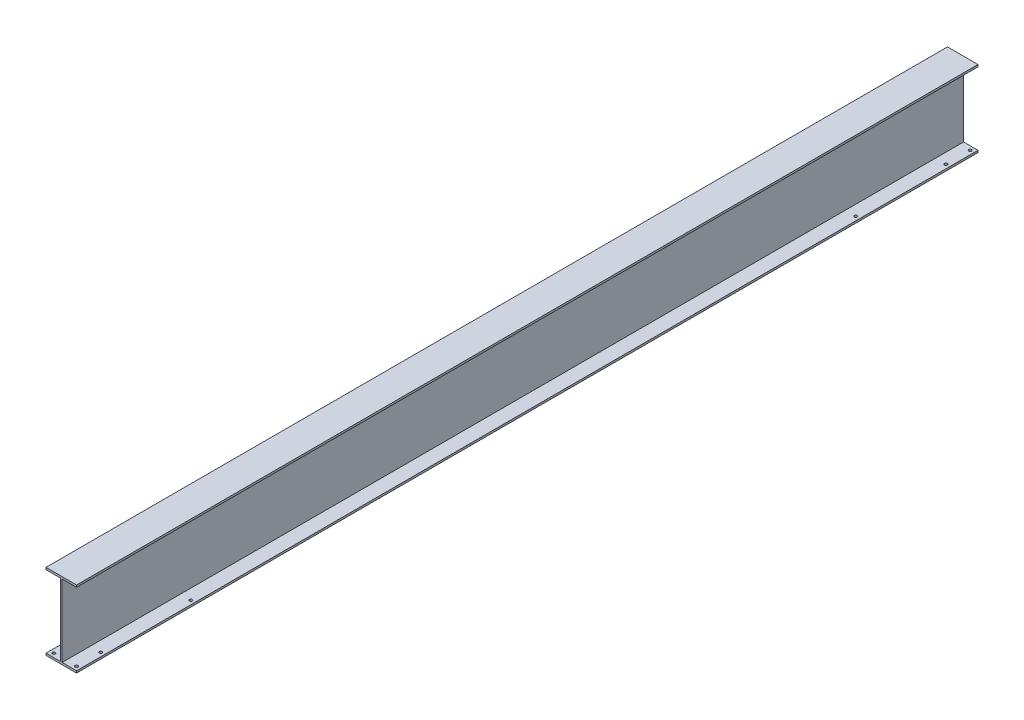
ISO-10303-21;
HEADER;
FILE_DESCRIPTION(('STEP AP214'),'2;1');
FILE_NAME('part.step','',(''),(''),'','','');
FILE_SCHEMA(('AUTOMOTIVE_DESIGN { 1 0 10303 214 1 1 1 1 }'));
ENDSEC;
DATA;
#1=APPLICATION_CONTEXT('core data for automotive mechanical design processes');
#2=APPLICATION_PROTOCOL_DEFINITION('international standard','automotive_design',2000,#1);
#3=PRODUCT_CONTEXT('',#1,'mechanical');
#4=PRODUCT('Part','Part','',(#3));
#5=PRODUCT_RELATED_PRODUCT_CATEGORY('part','',(#4));
#6=PRODUCT_DEFINITION_FORMATION('','',#4);
#7=PRODUCT_DEFINITION_CONTEXT('part definition',#1,'design');
#8=PRODUCT_DEFINITION('design','',#6,#7);
#9=PRODUCT_DEFINITION_SHAPE('','',#8);
#10=(LENGTH_UNIT() NAMED_UNIT(*) SI_UNIT(.MILLI.,.METRE.));
#11=(NAMED_UNIT(*) PLANE_ANGLE_UNIT() SI_UNIT($,.RADIAN.));
#12=(NAMED_UNIT(*) SI_UNIT($,.STERADIAN.) SOLID_ANGLE_UNIT());
#13=UNCERTAINTY_MEASURE_WITH_UNIT(LENGTH_MEASURE(1.E-05),#10,'distance_accuracy_value','');
#14=(GEOMETRIC_REPRESENTATION_CONTEXT(3) GLOBAL_UNCERTAINTY_ASSIGNED_CONTEXT((#13)) GLOBAL_UNIT_ASSIGNED_CONTEXT((#10,
#11,#12)) REPRESENTATION_CONTEXT('',''));
#15=CARTESIAN_POINT('',(0.,0.,0.));
#16=DIRECTION('',(0.,0.,1.));
#17=DIRECTION('',(1.,0.,0.));
#18=AXIS2_PLACEMENT_3D('',#15,#16,#17);
#19=CARTESIAN_POINT('',(0.,0.,3000.));
#20=DIRECTION('',(1.,0.,0.));
#21=DIRECTION('',(0.,1.,0.));
#22=AXIS2_PLACEMENT_3D('',#19,#20,#21);
#23=PLANE('',#22);
#24=DIRECTION('',(0.,-1.,0.));
#25=VECTOR('',#24,1.);
#26=CARTESIAN_POINT('',(0.,0.,0.));
#27=LINE('',#26,#25);
#28=CARTESIAN_POINT('',(0.,0.,0.));
#29=VERTEX_POINT('',#28);
#30=CARTESIAN_POINT('',(0.,-6.8,0.));
#31=VERTEX_POINT('',#30);
#32=EDGE_CURVE('E152',#29,#31,#27,.T.);
#33=ORIENTED_EDGE('',*,*,#32,.T.);
#34=DIRECTION('',(0.,0.,-1.));
#35=VECTOR('',#34,1.);
#36=CARTESIAN_POINT('',(0.,-6.8,3000.));
#37=LINE('',#36,#35);
#38=CARTESIAN_POINT('',(0.,-6.8,3000.));
#39=VERTEX_POINT('',#38);
#40=EDGE_CURVE('E11',#39,#31,#37,.T.);
#41=ORIENTED_EDGE('',*,*,#40,.F.);
#42=DIRECTION('',(0.,-1.,0.));
#43=VECTOR('',#42,1.);
#44=CARTESIAN_POINT('',(0.,0.,3000.));
#45=LINE('',#44,#43);
#46=CARTESIAN_POINT('',(0.,0.,3000.));
#47=VERTEX_POINT('',#46);
#48=EDGE_CURVE('E175',#47,#39,#45,.T.);
#49=ORIENTED_EDGE('',*,*,#48,.F.);
#50=DIRECTION('',(0.,0.,-1.));
#51=VECTOR('',#50,1.);
#52=CARTESIAN_POINT('',(0.,0.,3000.));
#53=LINE('',#52,#51);
#54=EDGE_CURVE('E148',#47,#29,#53,.T.);
#55=ORIENTED_EDGE('',*,*,#54,.T.);
#56=EDGE_LOOP('',(#33,#41,#49,#55));
#57=FACE_BOUND('',#56,.T.);
#58=ADVANCED_FACE('F32',(#57),#23,.F.);
#59=CARTESIAN_POINT('',(0.,-6.8,3000.));
#60=DIRECTION('',(0.,1.,0.));
#61=DIRECTION('',(0.,0.,1.));
#62=AXIS2_PLACEMENT_3D('',#59,#60,#61);
#63=PLANE('',#62);
#64=DIRECTION('',(1.,0.,0.));
#65=VECTOR('',#64,1.);
#66=CARTESIAN_POINT('',(0.,-6.8,0.));
#67=LINE('',#66,#65);
#68=CARTESIAN_POINT('',(47.9,-6.8,0.));
#69=VERTEX_POINT('',#68);
#70=EDGE_CURVE('E155',#31,#69,#67,.T.);
#71=ORIENTED_EDGE('',*,*,#70,.T.);
#72=DIRECTION('',(0.,0.,-1.));
#73=VECTOR('',#72,1.);
#74=CARTESIAN_POINT('',(47.9,-6.8,3000.));
#75=LINE('',#74,#73);
#76=CARTESIAN_POINT('',(47.9,-6.8,3000.));
#77=VERTEX_POINT('',#76);
#78=EDGE_CURVE('E40',#77,#69,#75,.T.);
#79=ORIENTED_EDGE('',*,*,#78,.F.);
#80=DIRECTION('',(1.,0.,0.));
#81=VECTOR('',#80,1.);
#82=CARTESIAN_POINT('',(0.,-6.8,3000.));
#83=LINE('',#82,#81);
#84=EDGE_CURVE('E103',#39,#77,#83,.T.);
#85=ORIENTED_EDGE('',*,*,#84,.F.);
#86=ORIENTED_EDGE('',*,*,#40,.T.);
#87=EDGE_LOOP('',(#71,#79,#85,#86));
#88=FACE_BOUND('',#87,.T.);
#89=ADVANCED_FACE('F253',(#88),#63,.F.);
#90=CARTESIAN_POINT('',(47.9,-6.8,3000.));
#91=DIRECTION('',(1.,0.,0.));
#92=DIRECTION('',(0.,1.,0.));
#93=AXIS2_PLACEMENT_3D('',#90,#91,#92);
#94=PLANE('',#93);
#95=DIRECTION('',(0.,-1.,0.));
#96=VECTOR('',#95,1.);
#97=CARTESIAN_POINT('',(47.9,-6.8,0.));
#98=LINE('',#97,#96);
#99=CARTESIAN_POINT('',(47.9,-247.2,0.));
#100=VERTEX_POINT('',#99);
#101=EDGE_CURVE('E158',#69,#100,#98,.T.);
#102=ORIENTED_EDGE('',*,*,#101,.T.);
#103=DIRECTION('',(0.,0.,-1.));
#104=VECTOR('',#103,1.);
#105=CARTESIAN_POINT('',(47.9,-247.2,3000.));
#106=LINE('',#105,#104);
#107=CARTESIAN_POINT('',(47.9,-247.2,3000.));
#108=VERTEX_POINT('',#107);
#109=EDGE_CURVE('E194',#108,#100,#106,.T.);
#110=ORIENTED_EDGE('',*,*,#109,.F.);
#111=DIRECTION('',(0.,-1.,0.));
#112=VECTOR('',#111,1.);
#113=CARTESIAN_POINT('',(47.9,-6.8,3000.));
#114=LINE('',#113,#112);
#115=EDGE_CURVE('E202',#77,#108,#114,.T.);
#116=ORIENTED_EDGE('',*,*,#115,.F.);
#117=ORIENTED_EDGE('',*,*,#78,.T.);
#118=EDGE_LOOP('',(#102,#110,#116,#117));
#119=FACE_BOUND('',#118,.T.);
#120=ADVANCED_FACE('F200',(#119),#94,.F.);
#121=CARTESIAN_POINT('',(47.9,-247.2,3000.));
#122=DIRECTION('',(0.,-1.,0.));
#123=DIRECTION('',(0.,0.,-1.));
#124=AXIS2_PLACEMENT_3D('',#121,#122,#123);
#125=PLANE('',#124);
#126=CARTESIAN_POINT('',(12.9999999999997,-247.2,2606.6));
#127=DIRECTION('',(0.,-1.,0.));
#128=DIRECTION('',(0.,0.,-1.));
#129=AXIS2_PLACEMENT_3D('',#126,#127,#128);
#130=CIRCLE('',#129,4.76250000000005);
#131=CARTESIAN_POINT('',(12.9999999999997,-247.2,2601.8375));
#132=VERTEX_POINT('',#131);
#133=EDGE_CURVE('E445',#132,#132,#130,.F.);
#134=ORIENTED_EDGE('',*,*,#133,.F.);
#135=EDGE_LOOP('',(#134));
#136=FACE_BOUND('',#135,.T.);
#137=CARTESIAN_POINT('',(13.,-247.2,393.4));
#138=DIRECTION('',(0.,-1.,0.));
#139=DIRECTION('',(0.,0.,-1.));
#140=AXIS2_PLACEMENT_3D('',#137,#138,#139);
#141=CIRCLE('',#140,4.76250000000003);
#142=CARTESIAN_POINT('',(13.,-247.2,388.6375));
#143=VERTEX_POINT('',#142);
#144=EDGE_CURVE('E450',#143,#143,#141,.F.);
#145=ORIENTED_EDGE('',*,*,#144,.F.);
#146=EDGE_LOOP('',(#145));
#147=FACE_BOUND('',#146,.T.);
#148=CARTESIAN_POINT('',(12.9999999999997,-247.2,2906.61));
#149=DIRECTION('',(0.,-1.,0.));
#150=DIRECTION('',(0.,0.,-1.));
#151=AXIS2_PLACEMENT_3D('',#148,#149,#150);
#152=CIRCLE('',#151,4.76250000000005);
#153=CARTESIAN_POINT('',(12.9999999999997,-247.2,2901.8475));
#154=VERTEX_POINT('',#153);
#155=EDGE_CURVE('E506',#154,#154,#152,.F.);
#156=ORIENTED_EDGE('',*,*,#155,.F.);
#157=EDGE_LOOP('',(#156));
#158=FACE_BOUND('',#157,.T.);
#159=CARTESIAN_POINT('',(12.9999999999997,-247.2,2987.));
#160=DIRECTION('',(0.,-1.,0.));
#161=DIRECTION('',(0.,0.,-1.));
#162=AXIS2_PLACEMENT_3D('',#159,#160,#161);
#163=CIRCLE('',#162,4.76250000000005);
#164=CARTESIAN_POINT('',(12.9999999999997,-247.2,2982.2375));
#165=VERTEX_POINT('',#164);
#166=EDGE_CURVE('E487',#165,#165,#163,.F.);
#167=ORIENTED_EDGE('',*,*,#166,.F.);
#168=EDGE_LOOP('',(#167));
#169=FACE_BOUND('',#168,.T.);
#170=CARTESIAN_POINT('',(13.,-247.2,12.9999999999999));
#171=DIRECTION('',(0.,-1.,0.));
#172=DIRECTION('',(0.,0.,-1.));
#173=AXIS2_PLACEMENT_3D('',#170,#171,#172);
#174=CIRCLE('',#173,4.76250000000003);
#175=CARTESIAN_POINT('',(13.,-247.2,8.23749999999987));
#176=VERTEX_POINT('',#175);
#177=EDGE_CURVE('E488',#176,#176,#174,.F.);
#178=ORIENTED_EDGE('',*,*,#177,.F.);
#179=EDGE_LOOP('',(#178));
#180=FACE_BOUND('',#179,.T.);
#181=CARTESIAN_POINT('',(13.,-247.2,93.3899999999999));
#182=DIRECTION('',(0.,-1.,0.));
#183=DIRECTION('',(0.,0.,-1.));
#184=AXIS2_PLACEMENT_3D('',#181,#182,#183);
#185=CIRCLE('',#184,4.76250000000003);
#186=CARTESIAN_POINT('',(13.,-247.2,88.6274999999998));
#187=VERTEX_POINT('',#186);
#188=EDGE_CURVE('E495',#187,#187,#185,.F.);
#189=ORIENTED_EDGE('',*,*,#188,.F.);
#190=EDGE_LOOP('',(#189));
#191=FACE_BOUND('',#190,.T.);
#192=DIRECTION('',(-1.,0.,0.));
#193=VECTOR('',#192,1.);
#194=CARTESIAN_POINT('',(47.9,-247.2,0.));
#195=LINE('',#194,#193);
#196=CARTESIAN_POINT('',(0.,-247.2,0.));
#197=VERTEX_POINT('',#196);
#198=EDGE_CURVE('E160',#100,#197,#195,.T.);
#199=ORIENTED_EDGE('',*,*,#198,.T.);
#200=DIRECTION('',(0.,0.,-1.));
#201=VECTOR('',#200,1.);
#202=CARTESIAN_POINT('',(0.,-247.2,3000.));
#203=LINE('',#202,#201);
#204=CARTESIAN_POINT('',(0.,-247.2,3000.));
#205=VERTEX_POINT('',#204);
#206=EDGE_CURVE('E191',#205,#197,#203,.T.);
#207=ORIENTED_EDGE('',*,*,#206,.F.);
#208=DIRECTION('',(-1.,0.,0.));
#209=VECTOR('',#208,1.);
#210=CARTESIAN_POINT('',(47.9,-247.2,3000.));
#211=LINE('',#210,#209);
#212=EDGE_CURVE('E220',#108,#205,#211,.T.);
#213=ORIENTED_EDGE('',*,*,#212,.F.);
#214=ORIENTED_EDGE('',*,*,#109,.T.);
#215=EDGE_LOOP('',(#199,#207,#213,#214));
#216=FACE_BOUND('',#215,.T.);
#217=ADVANCED_FACE('F211',(#136,#147,#158,#169,#180,#191,#216),#125,.F.);
#218=CARTESIAN_POINT('',(0.,-247.2,3000.));
#219=DIRECTION('',(1.,0.,0.));
#220=DIRECTION('',(0.,1.,0.));
#221=AXIS2_PLACEMENT_3D('',#218,#219,#220);
#222=PLANE('',#221);
#223=DIRECTION('',(0.,-1.,0.));
#224=VECTOR('',#223,1.);
#225=CARTESIAN_POINT('',(0.,-247.2,0.));
#226=LINE('',#225,#224);
#227=CARTESIAN_POINT('',(0.,-254.,0.));
#228=VERTEX_POINT('',#227);
#229=EDGE_CURVE('E162',#197,#228,#226,.T.);
#230=ORIENTED_EDGE('',*,*,#229,.T.);
#231=DIRECTION('',(0.,0.,-1.));
#232=VECTOR('',#231,1.);
#233=CARTESIAN_POINT('',(0.,-254.,3000.));
#234=LINE('',#233,#232);
#235=CARTESIAN_POINT('',(0.,-254.,3000.));
#236=VERTEX_POINT('',#235);
#237=EDGE_CURVE('E188',#236,#228,#234,.T.);
#238=ORIENTED_EDGE('',*,*,#237,.F.);
#239=DIRECTION('',(0.,-1.,0.));
#240=VECTOR('',#239,1.);
#241=CARTESIAN_POINT('',(0.,-247.2,3000.));
#242=LINE('',#241,#240);
#243=EDGE_CURVE('E217',#205,#236,#242,.T.);
#244=ORIENTED_EDGE('',*,*,#243,.F.);
#245=ORIENTED_EDGE('',*,*,#206,.T.);
#246=EDGE_LOOP('',(#230,#238,#244,#245));
#247=FACE_BOUND('',#246,.T.);
#248=ADVANCED_FACE('F215',(#247),#222,.F.);
#249=CARTESIAN_POINT('',(0.,-254.,3000.));
#250=DIRECTION('',(0.,1.,0.));
#251=DIRECTION('',(0.,0.,1.));
#252=AXIS2_PLACEMENT_3D('',#249,#250,#251);
#253=PLANE('',#252);
#254=CARTESIAN_POINT('',(88.5999999999997,-254.,2606.6));
#255=DIRECTION('',(0.,-1.,0.));
#256=DIRECTION('',(0.,0.,-1.));
#257=AXIS2_PLACEMENT_3D('',#254,#255,#256);
#258=CIRCLE('',#257,4.76250000000005);
#259=CARTESIAN_POINT('',(88.5999999999997,-254.,2601.8375));
#260=VERTEX_POINT('',#259);
#261=EDGE_CURVE('E452',#260,#260,#258,.T.);
#262=ORIENTED_EDGE('',*,*,#261,.F.);
#263=EDGE_LOOP('',(#262));
#264=FACE_BOUND('',#263,.T.);
#265=CARTESIAN_POINT('',(88.6,-254.,12.9999999999999));
#266=DIRECTION('',(0.,-1.,0.));
#267=DIRECTION('',(0.,0.,1.));
#268=AXIS2_PLACEMENT_3D('',#265,#266,#267);
#269=CIRCLE('',#268,4.76250000000003);
#270=CARTESIAN_POINT('',(88.6,-254.,17.7624999999999));
#271=VERTEX_POINT('',#270);
#272=EDGE_CURVE('E466',#271,#271,#269,.T.);
#273=ORIENTED_EDGE('',*,*,#272,.F.);
#274=EDGE_LOOP('',(#273));
#275=FACE_BOUND('',#274,.T.);
#276=CARTESIAN_POINT('',(88.6,-254.,93.3899999999999));
#277=DIRECTION('',(0.,-1.,0.));
#278=DIRECTION('',(0.,0.,1.));
#279=AXIS2_PLACEMENT_3D('',#276,#277,#278);
#280=CIRCLE('',#279,4.76250000000004);
#281=CARTESIAN_POINT('',(88.6,-254.,98.1524999999999));
#282=VERTEX_POINT('',#281);
#283=EDGE_CURVE('E473',#282,#282,#280,.T.);
#284=ORIENTED_EDGE('',*,*,#283,.F.);
#285=EDGE_LOOP('',(#284));
#286=FACE_BOUND('',#285,.T.);
#287=CARTESIAN_POINT('',(12.9999999999997,-254.,2606.6));
#288=DIRECTION('',(0.,-1.,0.));
#289=DIRECTION('',(0.,0.,1.));
#290=AXIS2_PLACEMENT_3D('',#287,#288,#289);
#291=CIRCLE('',#290,4.76250000000005);
#292=CARTESIAN_POINT('',(12.9999999999997,-254.,2611.3625));
#293=VERTEX_POINT('',#292);
#294=EDGE_CURVE('E448',#293,#293,#291,.T.);
#295=ORIENTED_EDGE('',*,*,#294,.F.);
#296=EDGE_LOOP('',(#295));
#297=FACE_BOUND('',#296,.T.);
#298=CARTESIAN_POINT('',(13.,-254.,393.4));
#299=DIRECTION('',(0.,-1.,0.));
#300=DIRECTION('',(0.,0.,-1.));
#301=AXIS2_PLACEMENT_3D('',#298,#299,#300);
#302=CIRCLE('',#301,4.76250000000003);
#303=CARTESIAN_POINT('',(13.,-254.,388.6375));
#304=VERTEX_POINT('',#303);
#305=EDGE_CURVE('E455',#304,#304,#302,.T.);
#306=ORIENTED_EDGE('',*,*,#305,.F.);
#307=EDGE_LOOP('',(#306));
#308=FACE_BOUND('',#307,.T.);
#309=CARTESIAN_POINT('',(88.6,-254.,393.4));
#310=DIRECTION('',(0.,-1.,0.));
#311=DIRECTION('',(0.,0.,1.));
#312=AXIS2_PLACEMENT_3D('',#309,#310,#311);
#313=CIRCLE('',#312,4.76250000000004);
#314=CARTESIAN_POINT('',(88.6,-254.,398.1625));
#315=VERTEX_POINT('',#314);
#316=EDGE_CURVE('E461',#315,#315,#313,.T.);
#317=ORIENTED_EDGE('',*,*,#316,.F.);
#318=EDGE_LOOP('',(#317));
#319=FACE_BOUND('',#318,.T.);
#320=CARTESIAN_POINT('',(88.5999999999997,-254.,2906.61));
#321=DIRECTION('',(0.,-1.,0.));
#322=DIRECTION('',(0.,0.,-1.));
#323=AXIS2_PLACEMENT_3D('',#320,#321,#322);
#324=CIRCLE('',#323,4.76250000000005);
#325=CARTESIAN_POINT('',(88.5999999999997,-254.,2901.8475));
#326=VERTEX_POINT('',#325);
#327=EDGE_CURVE('E502',#326,#326,#324,.T.);
#328=ORIENTED_EDGE('',*,*,#327,.F.);
#329=EDGE_LOOP('',(#328));
#330=FACE_BOUND('',#329,.T.);
#331=CARTESIAN_POINT('',(12.9999999999997,-254.,2906.61));
#332=DIRECTION('',(0.,-1.,0.));
#333=DIRECTION('',(0.,0.,1.));
#334=AXIS2_PLACEMENT_3D('',#331,#332,#333);
#335=CIRCLE('',#334,4.76250000000005);
#336=CARTESIAN_POINT('',(12.9999999999997,-254.,2911.3725));
#337=VERTEX_POINT('',#336);
#338=EDGE_CURVE('E491',#337,#337,#335,.T.);
#339=ORIENTED_EDGE('',*,*,#338,.F.);
#340=EDGE_LOOP('',(#339));
#341=FACE_BOUND('',#340,.T.);
#342=CARTESIAN_POINT('',(12.9999999999997,-254.,2987.));
#343=DIRECTION('',(0.,-1.,0.));
#344=DIRECTION('',(0.,0.,1.));
#345=AXIS2_PLACEMENT_3D('',#342,#343,#344);
#346=CIRCLE('',#345,4.76250000000005);
#347=CARTESIAN_POINT('',(12.9999999999997,-254.,2991.7625));
#348=VERTEX_POINT('',#347);
#349=EDGE_CURVE('E484',#348,#348,#346,.T.);
#350=ORIENTED_EDGE('',*,*,#349,.F.);
#351=EDGE_LOOP('',(#350));
#352=FACE_BOUND('',#351,.T.);
#353=CARTESIAN_POINT('',(13.,-254.,12.9999999999999));
#354=DIRECTION('',(0.,-1.,0.));
#355=DIRECTION('',(0.,0.,-1.));
#356=AXIS2_PLACEMENT_3D('',#353,#354,#355);
#357=CIRCLE('',#356,4.76250000000003);
#358=CARTESIAN_POINT('',(13.,-254.,8.23749999999987));
#359=VERTEX_POINT('',#358);
#360=EDGE_CURVE('E492',#359,#359,#357,.T.);
#361=ORIENTED_EDGE('',*,*,#360,.F.);
#362=EDGE_LOOP('',(#361));
#363=FACE_BOUND('',#362,.T.);
#364=CARTESIAN_POINT('',(13.,-254.,93.3899999999999));
#365=DIRECTION('',(0.,-1.,0.));
#366=DIRECTION('',(0.,0.,-1.));
#367=AXIS2_PLACEMENT_3D('',#364,#365,#366);
#368=CIRCLE('',#367,4.76250000000003);
#369=CARTESIAN_POINT('',(13.,-254.,88.6274999999998));
#370=VERTEX_POINT('',#369);
#371=EDGE_CURVE('E483',#370,#370,#368,.T.);
#372=ORIENTED_EDGE('',*,*,#371,.F.);
#373=EDGE_LOOP('',(#372));
#374=FACE_BOUND('',#373,.T.);
#375=CARTESIAN_POINT('',(88.5999999999997,-254.,2987.));
#376=DIRECTION('',(0.,-1.,0.));
#377=DIRECTION('',(0.,0.,-1.));
#378=AXIS2_PLACEMENT_3D('',#375,#376,#377);
#379=CIRCLE('',#378,4.76250000000005);
#380=CARTESIAN_POINT('',(88.5999999999997,-254.,2982.2375));
#381=VERTEX_POINT('',#380);
#382=EDGE_CURVE('E509',#381,#381,#379,.T.);
#383=ORIENTED_EDGE('',*,*,#382,.F.);
#384=EDGE_LOOP('',(#383));
#385=FACE_BOUND('',#384,.T.);
#386=DIRECTION('',(1.,0.,0.));
#387=VECTOR('',#386,1.);
#388=CARTESIAN_POINT('',(0.,-254.,0.));
#389=LINE('',#388,#387);
#390=CARTESIAN_POINT('',(101.6,-254.,0.));
#391=VERTEX_POINT('',#390);
#392=EDGE_CURVE('E164',#228,#391,#389,.T.);
#393=ORIENTED_EDGE('',*,*,#392,.T.);
#394=DIRECTION('',(0.,0.,-1.));
#395=VECTOR('',#394,1.);
#396=CARTESIAN_POINT('',(101.6,-254.,3000.));
#397=LINE('',#396,#395);
#398=CARTESIAN_POINT('',(101.6,-254.,3000.));
#399=VERTEX_POINT('',#398);
#400=EDGE_CURVE('E185',#399,#391,#397,.T.);
#401=ORIENTED_EDGE('',*,*,#400,.F.);
#402=DIRECTION('',(1.,0.,0.));
#403=VECTOR('',#402,1.);
#404=CARTESIAN_POINT('',(0.,-254.,3000.));
#405=LINE('',#404,#403);
#406=EDGE_CURVE('E219',#236,#399,#405,.T.);
#407=ORIENTED_EDGE('',*,*,#406,.F.);
#408=ORIENTED_EDGE('',*,*,#237,.T.);
#409=EDGE_LOOP('',(#393,#401,#407,#408));
#410=FACE_BOUND('',#409,.T.);
#411=ADVANCED_FACE('F267',(#264,#275,#286,#297,#308,#319,#330,#341,#352,#363,#374,#385,#410),
#253,.F.);
#412=CARTESIAN_POINT('',(101.6,-247.2,3000.));
#413=DIRECTION('',(-1.,0.,0.));
#414=DIRECTION('',(0.,0.,1.));
#415=AXIS2_PLACEMENT_3D('',#412,#413,#414);
#416=PLANE('',#415);
#417=DIRECTION('',(0.,1.,0.));
#418=VECTOR('',#417,1.);
#419=CARTESIAN_POINT('',(101.6,-247.2,0.));
#420=LINE('',#419,#418);
#421=CARTESIAN_POINT('',(101.6,-247.2,0.));
#422=VERTEX_POINT('',#421);
#423=EDGE_CURVE('E166',#391,#422,#420,.T.);
#424=ORIENTED_EDGE('',*,*,#423,.T.);
#425=DIRECTION('',(0.,0.,-1.));
#426=VECTOR('',#425,1.);
#427=CARTESIAN_POINT('',(101.6,-247.2,3000.));
#428=LINE('',#427,#426);
#429=CARTESIAN_POINT('',(101.6,-247.2,3000.));
#430=VERTEX_POINT('',#429);
#431=EDGE_CURVE('E182',#430,#422,#428,.T.);
#432=ORIENTED_EDGE('',*,*,#431,.F.);
#433=DIRECTION('',(0.,1.,0.));
#434=VECTOR('',#433,1.);
#435=CARTESIAN_POINT('',(101.6,-247.2,3000.));
#436=LINE('',#435,#434);
#437=EDGE_CURVE('E222',#399,#430,#436,.T.);
#438=ORIENTED_EDGE('',*,*,#437,.F.);
#439=ORIENTED_EDGE('',*,*,#400,.T.);
#440=EDGE_LOOP('',(#424,#432,#438,#439));
#441=FACE_BOUND('',#440,.T.);
#442=ADVANCED_FACE('F270',(#441),#416,.F.);
#443=CARTESIAN_POINT('',(53.7,-247.2,3000.));
#444=DIRECTION('',(0.,-1.,0.));
#445=DIRECTION('',(0.,0.,-1.));
#446=AXIS2_PLACEMENT_3D('',#443,#444,#445);
#447=PLANE('',#446);
#448=CARTESIAN_POINT('',(88.5999999999997,-247.2,2606.6));
#449=DIRECTION('',(0.,-1.,0.));
#450=DIRECTION('',(0.,0.,-1.));
#451=AXIS2_PLACEMENT_3D('',#448,#449,#450);
#452=CIRCLE('',#451,4.76250000000005);
#453=CARTESIAN_POINT('',(88.5999999999997,-247.2,2601.8375));
#454=VERTEX_POINT('',#453);
#455=EDGE_CURVE('E470',#454,#454,#452,.F.);
#456=ORIENTED_EDGE('',*,*,#455,.F.);
#457=EDGE_LOOP('',(#456));
#458=FACE_BOUND('',#457,.T.);
#459=CARTESIAN_POINT('',(88.6,-247.2,12.9999999999999));
#460=DIRECTION('',(0.,-1.,0.));
#461=DIRECTION('',(0.,0.,-1.));
#462=AXIS2_PLACEMENT_3D('',#459,#460,#461);
#463=CIRCLE('',#462,4.76250000000003);
#464=CARTESIAN_POINT('',(88.6,-247.2,8.23749999999988));
#465=VERTEX_POINT('',#464);
#466=EDGE_CURVE('E469',#465,#465,#463,.F.);
#467=ORIENTED_EDGE('',*,*,#466,.F.);
#468=EDGE_LOOP('',(#467));
#469=FACE_BOUND('',#468,.T.);
#470=CARTESIAN_POINT('',(88.6,-247.2,93.3899999999999));
#471=DIRECTION('',(0.,-1.,0.));
#472=DIRECTION('',(0.,0.,-1.));
#473=AXIS2_PLACEMENT_3D('',#470,#471,#472);
#474=CIRCLE('',#473,4.76250000000004);
#475=CARTESIAN_POINT('',(88.6,-247.2,88.6274999999998));
#476=VERTEX_POINT('',#475);
#477=EDGE_CURVE('E480',#476,#476,#474,.F.);
#478=ORIENTED_EDGE('',*,*,#477,.F.);
#479=EDGE_LOOP('',(#478));
#480=FACE_BOUND('',#479,.T.);
#481=CARTESIAN_POINT('',(88.6,-247.2,393.4));
#482=DIRECTION('',(0.,-1.,0.));
#483=DIRECTION('',(0.,0.,-1.));
#484=AXIS2_PLACEMENT_3D('',#481,#482,#483);
#485=CIRCLE('',#484,4.76250000000004);
#486=CARTESIAN_POINT('',(88.6,-247.2,388.6375));
#487=VERTEX_POINT('',#486);
#488=EDGE_CURVE('E459',#487,#487,#485,.F.);
#489=ORIENTED_EDGE('',*,*,#488,.F.);
#490=EDGE_LOOP('',(#489));
#491=FACE_BOUND('',#490,.T.);
#492=CARTESIAN_POINT('',(88.5999999999997,-247.2,2906.61));
#493=DIRECTION('',(0.,-1.,0.));
#494=DIRECTION('',(0.,0.,-1.));
#495=AXIS2_PLACEMENT_3D('',#492,#493,#494);
#496=CIRCLE('',#495,4.76250000000005);
#497=CARTESIAN_POINT('',(88.5999999999997,-247.2,2901.8475));
#498=VERTEX_POINT('',#497);
#499=EDGE_CURVE('E505',#498,#498,#496,.F.);
#500=ORIENTED_EDGE('',*,*,#499,.F.);
#501=EDGE_LOOP('',(#500));
#502=FACE_BOUND('',#501,.T.);
#503=CARTESIAN_POINT('',(88.5999999999997,-247.2,2987.));
#504=DIRECTION('',(0.,-1.,0.));
#505=DIRECTION('',(0.,0.,-1.));
#506=AXIS2_PLACEMENT_3D('',#503,#504,#505);
#507=CIRCLE('',#506,4.76250000000005);
#508=CARTESIAN_POINT('',(88.5999999999997,-247.2,2982.2375));
#509=VERTEX_POINT('',#508);
#510=EDGE_CURVE('E156',#509,#509,#507,.F.);
#511=ORIENTED_EDGE('',*,*,#510,.F.);
#512=EDGE_LOOP('',(#511));
#513=FACE_BOUND('',#512,.T.);
#514=DIRECTION('',(-1.,0.,0.));
#515=VECTOR('',#514,1.);
#516=CARTESIAN_POINT('',(53.7,-247.2,0.));
#517=LINE('',#516,#515);
#518=CARTESIAN_POINT('',(53.7,-247.2,0.));
#519=VERTEX_POINT('',#518);
#520=EDGE_CURVE('E168',#422,#519,#517,.T.);
#521=ORIENTED_EDGE('',*,*,#520,.T.);
#522=DIRECTION('',(0.,0.,-1.));
#523=VECTOR('',#522,1.);
#524=CARTESIAN_POINT('',(53.7,-247.2,3000.));
#525=LINE('',#524,#523);
#526=CARTESIAN_POINT('',(53.7,-247.2,3000.));
#527=VERTEX_POINT('',#526);
#528=EDGE_CURVE('E179',#527,#519,#525,.T.);
#529=ORIENTED_EDGE('',*,*,#528,.F.);
#530=DIRECTION('',(-1.,0.,0.));
#531=VECTOR('',#530,1.);
#532=CARTESIAN_POINT('',(53.7,-247.2,3000.));
#533=LINE('',#532,#531);
#534=EDGE_CURVE('E228',#430,#527,#533,.T.);
#535=ORIENTED_EDGE('',*,*,#534,.F.);
#536=ORIENTED_EDGE('',*,*,#431,.T.);
#537=EDGE_LOOP('',(#521,#529,#535,#536));
#538=FACE_BOUND('',#537,.T.);
#539=ADVANCED_FACE('F234',(#458,#469,#480,#491,#502,#513,#538),#447,.F.);
#540=CARTESIAN_POINT('',(53.7,-6.8,3000.));
#541=DIRECTION('',(-1.,0.,0.));
#542=DIRECTION('',(0.,-1.,0.));
#543=AXIS2_PLACEMENT_3D('',#540,#541,#542);
#544=PLANE('',#543);
#545=DIRECTION('',(0.,1.,0.));
#546=VECTOR('',#545,1.);
#547=CARTESIAN_POINT('',(53.7,-6.8,0.));
#548=LINE('',#547,#546);
#549=CARTESIAN_POINT('',(53.7,-6.8,0.));
#550=VERTEX_POINT('',#549);
#551=EDGE_CURVE('E170',#519,#550,#548,.T.);
#552=ORIENTED_EDGE('',*,*,#551,.T.);
#553=DIRECTION('',(0.,0.,-1.));
#554=VECTOR('',#553,1.);
#555=CARTESIAN_POINT('',(53.7,-6.8,3000.));
#556=LINE('',#555,#554);
#557=CARTESIAN_POINT('',(53.7,-6.8,3000.));
#558=VERTEX_POINT('',#557);
#559=EDGE_CURVE('E143',#558,#550,#556,.T.);
#560=ORIENTED_EDGE('',*,*,#559,.F.);
#561=DIRECTION('',(0.,1.,0.));
#562=VECTOR('',#561,1.);
#563=CARTESIAN_POINT('',(53.7,-6.8,3000.));
#564=LINE('',#563,#562);
#565=EDGE_CURVE('E134',#527,#558,#564,.T.);
#566=ORIENTED_EDGE('',*,*,#565,.F.);
#567=ORIENTED_EDGE('',*,*,#528,.T.);
#568=EDGE_LOOP('',(#552,#560,#566,#567));
#569=FACE_BOUND('',#568,.T.);
#570=ADVANCED_FACE('F238',(#569),#544,.F.);
#571=CARTESIAN_POINT('',(101.6,-6.79999999999999,3000.));
#572=DIRECTION('',(0.,1.,0.));
#573=DIRECTION('',(-1.,0.,0.));
#574=AXIS2_PLACEMENT_3D('',#571,#572,#573);
#575=PLANE('',#574);
#576=DIRECTION('',(1.,0.,0.));
#577=VECTOR('',#576,1.);
#578=CARTESIAN_POINT('',(101.6,-6.79999999999999,0.));
#579=LINE('',#578,#577);
#580=CARTESIAN_POINT('',(101.6,-6.79999999999999,0.));
#581=VERTEX_POINT('',#580);
#582=EDGE_CURVE('E142',#550,#581,#579,.T.);
#583=ORIENTED_EDGE('',*,*,#582,.T.);
#584=DIRECTION('',(0.,0.,-1.));
#585=VECTOR('',#584,1.);
#586=CARTESIAN_POINT('',(101.6,-6.79999999999999,3000.));
#587=LINE('',#586,#585);
#588=CARTESIAN_POINT('',(101.6,-6.79999999999999,3000.));
#589=VERTEX_POINT('',#588);
#590=EDGE_CURVE('E139',#589,#581,#587,.T.);
#591=ORIENTED_EDGE('',*,*,#590,.F.);
#592=DIRECTION('',(1.,0.,0.));
#593=VECTOR('',#592,1.);
#594=CARTESIAN_POINT('',(101.6,-6.79999999999999,3000.));
#595=LINE('',#594,#593);
#596=EDGE_CURVE('E128',#558,#589,#595,.T.);
#597=ORIENTED_EDGE('',*,*,#596,.F.);
#598=ORIENTED_EDGE('',*,*,#559,.T.);
#599=EDGE_LOOP('',(#583,#591,#597,#598));
#600=FACE_BOUND('',#599,.T.);
#601=ADVANCED_FACE('F140',(#600),#575,.F.);
#602=CARTESIAN_POINT('',(101.6,0.,3000.));
#603=DIRECTION('',(-1.,0.,0.));
#604=DIRECTION('',(0.,0.,1.));
#605=AXIS2_PLACEMENT_3D('',#602,#603,#604);
#606=PLANE('',#605);
#607=DIRECTION('',(0.,1.,0.));
#608=VECTOR('',#607,1.);
#609=CARTESIAN_POINT('',(101.6,0.,0.));
#610=LINE('',#609,#608);
#611=CARTESIAN_POINT('',(101.6,0.,0.));
#612=VERTEX_POINT('',#611);
#613=EDGE_CURVE('E89',#581,#612,#610,.T.);
#614=ORIENTED_EDGE('',*,*,#613,.T.);
#615=DIRECTION('',(0.,0.,-1.));
#616=VECTOR('',#615,1.);
#617=CARTESIAN_POINT('',(101.6,0.,3000.));
#618=LINE('',#617,#616);
#619=CARTESIAN_POINT('',(101.6,0.,3000.));
#620=VERTEX_POINT('',#619);
#621=EDGE_CURVE('E144',#620,#612,#618,.T.);
#622=ORIENTED_EDGE('',*,*,#621,.F.);
#623=DIRECTION('',(0.,1.,0.));
#624=VECTOR('',#623,1.);
#625=CARTESIAN_POINT('',(101.6,0.,3000.));
#626=LINE('',#625,#624);
#627=EDGE_CURVE('E132',#589,#620,#626,.T.);
#628=ORIENTED_EDGE('',*,*,#627,.F.);
#629=ORIENTED_EDGE('',*,*,#590,.T.);
#630=EDGE_LOOP('',(#614,#622,#628,#629));
#631=FACE_BOUND('',#630,.T.);
#632=ADVANCED_FACE('F146',(#631),#606,.F.);
#633=CARTESIAN_POINT('',(0.,0.,3000.));
#634=DIRECTION('',(0.,-1.,0.));
#635=DIRECTION('',(1.,0.,0.));
#636=AXIS2_PLACEMENT_3D('',#633,#634,#635);
#637=PLANE('',#636);
#638=DIRECTION('',(-1.,0.,0.));
#639=VECTOR('',#638,1.);
#640=CARTESIAN_POINT('',(0.,0.,0.));
#641=LINE('',#640,#639);
#642=EDGE_CURVE('E95',#612,#29,#641,.T.);
#643=ORIENTED_EDGE('',*,*,#642,.T.);
#644=ORIENTED_EDGE('',*,*,#54,.F.);
#645=DIRECTION('',(-1.,0.,0.));
#646=VECTOR('',#645,1.);
#647=CARTESIAN_POINT('',(0.,0.,3000.));
#648=LINE('',#647,#646);
#649=EDGE_CURVE('E48',#620,#47,#648,.T.);
#650=ORIENTED_EDGE('',*,*,#649,.F.);
#651=ORIENTED_EDGE('',*,*,#621,.T.);
#652=EDGE_LOOP('',(#643,#644,#650,#651));
#653=FACE_BOUND('',#652,.T.);
#654=ADVANCED_FACE('F242',(#653),#637,.F.);
#655=CARTESIAN_POINT('',(0.,0.,3000.));
#656=DIRECTION('',(0.,0.,1.));
#657=DIRECTION('',(1.,0.,0.));
#658=AXIS2_PLACEMENT_3D('',#655,#656,#657);
#659=PLANE('',#658);
#660=ORIENTED_EDGE('',*,*,#48,.T.);
#661=ORIENTED_EDGE('',*,*,#84,.T.);
#662=ORIENTED_EDGE('',*,*,#115,.T.);
#663=ORIENTED_EDGE('',*,*,#212,.T.);
#664=ORIENTED_EDGE('',*,*,#243,.T.);
#665=ORIENTED_EDGE('',*,*,#406,.T.);
#666=ORIENTED_EDGE('',*,*,#437,.T.);
#667=ORIENTED_EDGE('',*,*,#534,.T.);
#668=ORIENTED_EDGE('',*,*,#565,.T.);
#669=ORIENTED_EDGE('',*,*,#596,.T.);
#670=ORIENTED_EDGE('',*,*,#627,.T.);
#671=ORIENTED_EDGE('',*,*,#649,.T.);
#672=EDGE_LOOP('',(#660,#661,#662,#663,#664,#665,#666,#667,#668,#669,#670,#671));
#673=FACE_BOUND('',#672,.T.);
#674=ADVANCED_FACE('F130',(#673),#659,.T.);
#675=CARTESIAN_POINT('',(0.,0.,0.));
#676=DIRECTION('',(0.,0.,1.));
#677=DIRECTION('',(1.,0.,0.));
#678=AXIS2_PLACEMENT_3D('',#675,#676,#677);
#679=PLANE('',#678);
#680=ORIENTED_EDGE('',*,*,#32,.F.);
#681=ORIENTED_EDGE('',*,*,#642,.F.);
#682=ORIENTED_EDGE('',*,*,#613,.F.);
#683=ORIENTED_EDGE('',*,*,#582,.F.);
#684=ORIENTED_EDGE('',*,*,#551,.F.);
#685=ORIENTED_EDGE('',*,*,#520,.F.);
#686=ORIENTED_EDGE('',*,*,#423,.F.);
#687=ORIENTED_EDGE('',*,*,#392,.F.);
#688=ORIENTED_EDGE('',*,*,#229,.F.);
#689=ORIENTED_EDGE('',*,*,#198,.F.);
#690=ORIENTED_EDGE('',*,*,#101,.F.);
#691=ORIENTED_EDGE('',*,*,#70,.F.);
#692=EDGE_LOOP('',(#680,#681,#682,#683,#684,#685,#686,#687,#688,#689,#690,#691));
#693=FACE_BOUND('',#692,.T.);
#694=ADVANCED_FACE('F206',(#693),#679,.F.);
#695=CARTESIAN_POINT('',(88.5999999999997,-233.729615818396,2987.));
#696=DIRECTION('',(0.,-1.,0.));
#697=DIRECTION('',(0.,0.,-1.));
#698=AXIS2_PLACEMENT_3D('',#695,#696,#697);
#699=CYLINDRICAL_SURFACE('',#698,4.76250000000005);
#700=ORIENTED_EDGE('',*,*,#510,.T.);
#701=EDGE_LOOP('',(#700));
#702=FACE_BOUND('',#701,.T.);
#703=ORIENTED_EDGE('',*,*,#382,.T.);
#704=EDGE_LOOP('',(#703));
#705=FACE_BOUND('',#704,.T.);
#706=ADVANCED_FACE('F308',(#702,#705),#699,.F.);
#707=CARTESIAN_POINT('',(88.5999999999997,-233.729615818396,2906.61));
#708=DIRECTION('',(0.,-1.,0.));
#709=DIRECTION('',(0.,0.,-1.));
#710=AXIS2_PLACEMENT_3D('',#707,#708,#709);
#711=CYLINDRICAL_SURFACE('',#710,4.76250000000005);
#712=ORIENTED_EDGE('',*,*,#499,.T.);
#713=EDGE_LOOP('',(#712));
#714=FACE_BOUND('',#713,.T.);
#715=ORIENTED_EDGE('',*,*,#327,.T.);
#716=EDGE_LOOP('',(#715));
#717=FACE_BOUND('',#716,.T.);
#718=ADVANCED_FACE('F328',(#714,#717),#711,.F.);
#719=CARTESIAN_POINT('',(88.6,-233.729615818396,393.4));
#720=DIRECTION('',(0.,-1.,0.));
#721=DIRECTION('',(0.,0.,-1.));
#722=AXIS2_PLACEMENT_3D('',#719,#720,#721);
#723=CYLINDRICAL_SURFACE('',#722,4.76250000000004);
#724=ORIENTED_EDGE('',*,*,#488,.T.);
#725=EDGE_LOOP('',(#724));
#726=FACE_BOUND('',#725,.T.);
#727=ORIENTED_EDGE('',*,*,#316,.T.);
#728=EDGE_LOOP('',(#727));
#729=FACE_BOUND('',#728,.T.);
#730=ADVANCED_FACE('F338',(#726,#729),#723,.F.);
#731=CARTESIAN_POINT('',(88.6,-233.729615818396,93.3899999999999));
#732=DIRECTION('',(0.,-1.,0.));
#733=DIRECTION('',(0.,0.,-1.));
#734=AXIS2_PLACEMENT_3D('',#731,#732,#733);
#735=CYLINDRICAL_SURFACE('',#734,4.76250000000004);
#736=ORIENTED_EDGE('',*,*,#477,.T.);
#737=EDGE_LOOP('',(#736));
#738=FACE_BOUND('',#737,.T.);
#739=ORIENTED_EDGE('',*,*,#283,.T.);
#740=EDGE_LOOP('',(#739));
#741=FACE_BOUND('',#740,.T.);
#742=ADVANCED_FACE('F348',(#738,#741),#735,.F.);
#743=CARTESIAN_POINT('',(88.6,-233.729615818396,12.9999999999999));
#744=DIRECTION('',(0.,-1.,0.));
#745=DIRECTION('',(0.,0.,-1.));
#746=AXIS2_PLACEMENT_3D('',#743,#744,#745);
#747=CYLINDRICAL_SURFACE('',#746,4.76250000000003);
#748=ORIENTED_EDGE('',*,*,#466,.T.);
#749=EDGE_LOOP('',(#748));
#750=FACE_BOUND('',#749,.T.);
#751=ORIENTED_EDGE('',*,*,#272,.T.);
#752=EDGE_LOOP('',(#751));
#753=FACE_BOUND('',#752,.T.);
#754=ADVANCED_FACE('F358',(#750,#753),#747,.F.);
#755=CARTESIAN_POINT('',(88.5999999999997,-233.729615818396,2606.6));
#756=DIRECTION('',(0.,-1.,0.));
#757=DIRECTION('',(0.,0.,-1.));
#758=AXIS2_PLACEMENT_3D('',#755,#756,#757);
#759=CYLINDRICAL_SURFACE('',#758,4.76250000000005);
#760=ORIENTED_EDGE('',*,*,#455,.T.);
#761=EDGE_LOOP('',(#760));
#762=FACE_BOUND('',#761,.T.);
#763=ORIENTED_EDGE('',*,*,#261,.T.);
#764=EDGE_LOOP('',(#763));
#765=FACE_BOUND('',#764,.T.);
#766=ADVANCED_FACE('F368',(#762,#765),#759,.F.);
#767=CARTESIAN_POINT('',(13.,-233.729615818396,93.3899999999999));
#768=DIRECTION('',(0.,-1.,0.));
#769=DIRECTION('',(0.,0.,-1.));
#770=AXIS2_PLACEMENT_3D('',#767,#768,#769);
#771=CYLINDRICAL_SURFACE('',#770,4.76250000000003);
#772=ORIENTED_EDGE('',*,*,#188,.T.);
#773=EDGE_LOOP('',(#772));
#774=FACE_BOUND('',#773,.T.);
#775=ORIENTED_EDGE('',*,*,#371,.T.);
#776=EDGE_LOOP('',(#775));
#777=FACE_BOUND('',#776,.T.);
#778=ADVANCED_FACE('F378',(#774,#777),#771,.F.);
#779=CARTESIAN_POINT('',(13.,-233.729615818396,12.9999999999999));
#780=DIRECTION('',(0.,-1.,0.));
#781=DIRECTION('',(0.,0.,-1.));
#782=AXIS2_PLACEMENT_3D('',#779,#780,#781);
#783=CYLINDRICAL_SURFACE('',#782,4.76250000000003);
#784=ORIENTED_EDGE('',*,*,#177,.T.);
#785=EDGE_LOOP('',(#784));
#786=FACE_BOUND('',#785,.T.);
#787=ORIENTED_EDGE('',*,*,#360,.T.);
#788=EDGE_LOOP('',(#787));
#789=FACE_BOUND('',#788,.T.);
#790=ADVANCED_FACE('F388',(#786,#789),#783,.F.);
#791=CARTESIAN_POINT('',(12.9999999999997,-233.729615818396,2987.));
#792=DIRECTION('',(0.,-1.,0.));
#793=DIRECTION('',(0.,0.,-1.));
#794=AXIS2_PLACEMENT_3D('',#791,#792,#793);
#795=CYLINDRICAL_SURFACE('',#794,4.76250000000005);
#796=ORIENTED_EDGE('',*,*,#166,.T.);
#797=EDGE_LOOP('',(#796));
#798=FACE_BOUND('',#797,.T.);
#799=ORIENTED_EDGE('',*,*,#349,.T.);
#800=EDGE_LOOP('',(#799));
#801=FACE_BOUND('',#800,.T.);
#802=ADVANCED_FACE('F398',(#798,#801),#795,.F.);
#803=CARTESIAN_POINT('',(12.9999999999997,-233.729615818396,2906.61));
#804=DIRECTION('',(0.,-1.,0.));
#805=DIRECTION('',(0.,0.,-1.));
#806=AXIS2_PLACEMENT_3D('',#803,#804,#805);
#807=CYLINDRICAL_SURFACE('',#806,4.76250000000005);
#808=ORIENTED_EDGE('',*,*,#155,.T.);
#809=EDGE_LOOP('',(#808));
#810=FACE_BOUND('',#809,.T.);
#811=ORIENTED_EDGE('',*,*,#338,.T.);
#812=EDGE_LOOP('',(#811));
#813=FACE_BOUND('',#812,.T.);
#814=ADVANCED_FACE('F408',(#810,#813),#807,.F.);
#815=CARTESIAN_POINT('',(13.,-233.729615818396,393.4));
#816=DIRECTION('',(0.,-1.,0.));
#817=DIRECTION('',(0.,0.,-1.));
#818=AXIS2_PLACEMENT_3D('',#815,#816,#817);
#819=CYLINDRICAL_SURFACE('',#818,4.76250000000003);
#820=ORIENTED_EDGE('',*,*,#144,.T.);
#821=EDGE_LOOP('',(#820));
#822=FACE_BOUND('',#821,.T.);
#823=ORIENTED_EDGE('',*,*,#305,.T.);
#824=EDGE_LOOP('',(#823));
#825=FACE_BOUND('',#824,.T.);
#826=ADVANCED_FACE('F418',(#822,#825),#819,.F.);
#827=CARTESIAN_POINT('',(12.9999999999997,-233.729615818396,2606.6));
#828=DIRECTION('',(0.,-1.,0.));
#829=DIRECTION('',(0.,0.,-1.));
#830=AXIS2_PLACEMENT_3D('',#827,#828,#829);
#831=CYLINDRICAL_SURFACE('',#830,4.76250000000005);
#832=ORIENTED_EDGE('',*,*,#133,.T.);
#833=EDGE_LOOP('',(#832));
#834=FACE_BOUND('',#833,.T.);
#835=ORIENTED_EDGE('',*,*,#294,.T.);
#836=EDGE_LOOP('',(#835));
#837=FACE_BOUND('',#836,.T.);
#838=ADVANCED_FACE('F428',(#834,#837),#831,.F.);
#839=CLOSED_SHELL('',(#58,#89,#120,#217,#248,#411,#442,#539,#570,#601,#632,#654,#674,#694,#706,
#718,#730,#742,#754,#766,#778,#790,#802,#814,#826,#838));
#840=MANIFOLD_SOLID_BREP('B2',#839);
#841=ADVANCED_BREP_SHAPE_REPRESENTATION('',(#18,#840),#14);
#842=SHAPE_DEFINITION_REPRESENTATION(#9,#841);
ENDSEC;
END-ISO-10303-21;
